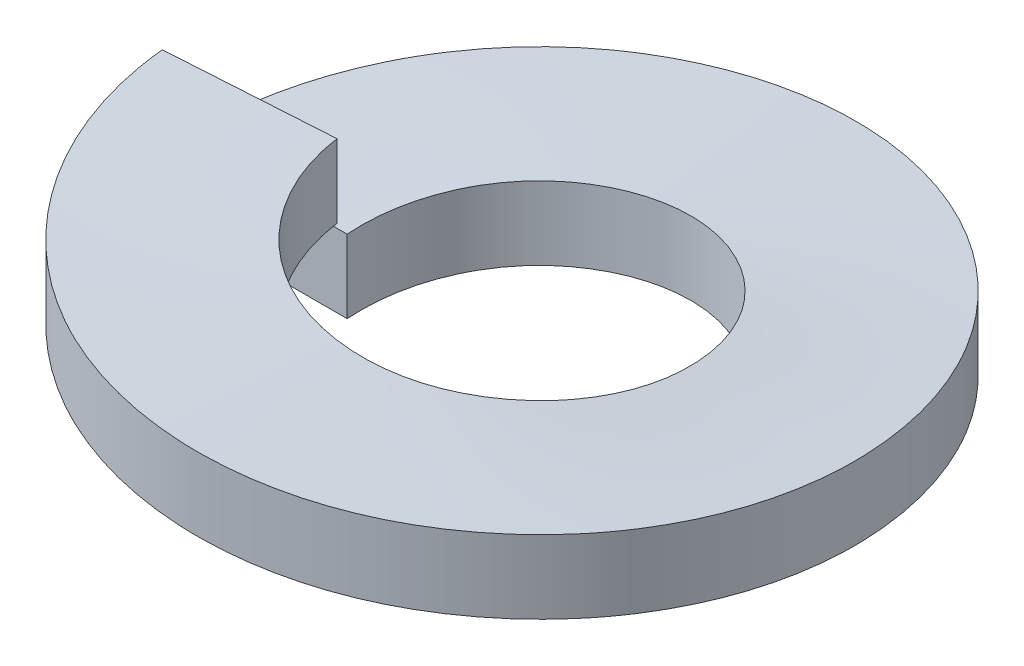
ISO-10303-21;
HEADER;
FILE_DESCRIPTION(('STEP AP214'),'2;1');
FILE_NAME('part.step','',(''),(''),'','','');
FILE_SCHEMA(('AUTOMOTIVE_DESIGN { 1 0 10303 214 1 1 1 1 }'));
ENDSEC;
DATA;
#1=APPLICATION_CONTEXT('core data for automotive mechanical design processes');
#2=APPLICATION_PROTOCOL_DEFINITION('international standard','automotive_design',2000,#1);
#3=PRODUCT_CONTEXT('',#1,'mechanical');
#4=PRODUCT('Part','Part','',(#3));
#5=PRODUCT_RELATED_PRODUCT_CATEGORY('part','',(#4));
#6=PRODUCT_DEFINITION_FORMATION('','',#4);
#7=PRODUCT_DEFINITION_CONTEXT('part definition',#1,'design');
#8=PRODUCT_DEFINITION('design','',#6,#7);
#9=PRODUCT_DEFINITION_SHAPE('','',#8);
#10=(LENGTH_UNIT() NAMED_UNIT(*) SI_UNIT(.MILLI.,.METRE.));
#11=(NAMED_UNIT(*) PLANE_ANGLE_UNIT() SI_UNIT($,.RADIAN.));
#12=(NAMED_UNIT(*) SI_UNIT($,.STERADIAN.) SOLID_ANGLE_UNIT());
#13=UNCERTAINTY_MEASURE_WITH_UNIT(LENGTH_MEASURE(1.E-05),#10,'distance_accuracy_value','');
#14=(GEOMETRIC_REPRESENTATION_CONTEXT(3) GLOBAL_UNCERTAINTY_ASSIGNED_CONTEXT((#13)) GLOBAL_UNIT_ASSIGNED_CONTEXT((#10,
#11,#12)) REPRESENTATION_CONTEXT('',''));
#15=CARTESIAN_POINT('',(0.,0.,0.));
#16=DIRECTION('',(0.,0.,1.));
#17=DIRECTION('',(1.,0.,0.));
#18=AXIS2_PLACEMENT_3D('',#15,#16,#17);
#19=CARTESIAN_POINT('',(-2.286,0.,0.));
#20=DIRECTION('',(0.,0.,1.));
#21=DIRECTION('',(1.,0.,0.));
#22=AXIS2_PLACEMENT_3D('',#19,#20,#21);
#23=PLANE('',#22);
#24=DIRECTION('',(0.,-1.,0.));
#25=VECTOR('',#24,1.);
#26=CARTESIAN_POINT('',(-2.286,0.508,0.));
#27=LINE('',#26,#25);
#28=CARTESIAN_POINT('',(-2.286,0.508,0.));
#29=VERTEX_POINT('',#28);
#30=CARTESIAN_POINT('',(-2.286,0.,0.));
#31=VERTEX_POINT('',#30);
#32=EDGE_CURVE('E84',#29,#31,#27,.T.);
#33=ORIENTED_EDGE('',*,*,#32,.T.);
#34=DIRECTION('',(1.,0.,0.));
#35=VECTOR('',#34,1.);
#36=CARTESIAN_POINT('',(-2.286,0.,0.));
#37=LINE('',#36,#35);
#38=CARTESIAN_POINT('',(-1.143,0.,0.));
#39=VERTEX_POINT('',#38);
#40=EDGE_CURVE('E77',#31,#39,#37,.T.);
#41=ORIENTED_EDGE('',*,*,#40,.T.);
#42=DIRECTION('',(0.,1.,0.));
#43=VECTOR('',#42,1.);
#44=CARTESIAN_POINT('',(-1.143,0.508000000000001,0.));
#45=LINE('',#44,#43);
#46=CARTESIAN_POINT('',(-1.143,0.508000000000001,0.));
#47=VERTEX_POINT('',#46);
#48=EDGE_CURVE('E72',#39,#47,#45,.T.);
#49=ORIENTED_EDGE('',*,*,#48,.T.);
#50=DIRECTION('',(-1.,0.,0.));
#51=VECTOR('',#50,1.);
#52=CARTESIAN_POINT('',(-2.286,0.508,0.));
#53=LINE('',#52,#51);
#54=EDGE_CURVE('E67',#47,#29,#53,.T.);
#55=ORIENTED_EDGE('',*,*,#54,.T.);
#56=EDGE_LOOP('',(#33,#41,#49,#55));
#57=FACE_BOUND('',#56,.T.);
#58=ADVANCED_FACE('F32',(#57),#23,.T.);
#59=CARTESIAN_POINT('',(-2.28148910118703,0.6096,0.14353912764398));
#60=DIRECTION('',(0.0627905195293,0.,0.998026728428272));
#61=DIRECTION('',(0.998026728428272,0.,-0.0627905195293));
#62=AXIS2_PLACEMENT_3D('',#59,#60,#61);
#63=PLANE('',#62);
#64=DIRECTION('',(0.,-1.,0.));
#65=VECTOR('',#64,1.);
#66=CARTESIAN_POINT('',(-2.28148910118703,1.1176,0.14353912764398));
#67=LINE('',#66,#65);
#68=CARTESIAN_POINT('',(-2.28148910118703,1.1176,0.143539127643978));
#69=VERTEX_POINT('',#68);
#70=CARTESIAN_POINT('',(-2.28148910118703,0.6096,0.143539127643979));
#71=VERTEX_POINT('',#70);
#72=EDGE_CURVE('E92',#69,#71,#67,.T.);
#73=ORIENTED_EDGE('',*,*,#72,.F.);
#74=DIRECTION('',(-0.998026728428272,0.,0.0627905195293));
#75=VECTOR('',#74,1.);
#76=CARTESIAN_POINT('',(-2.28148910118703,1.1176,0.14353912764398));
#77=LINE('',#76,#75);
#78=CARTESIAN_POINT('',(-1.14074455059351,1.1176,0.0717695638219887));
#79=VERTEX_POINT('',#78);
#80=EDGE_CURVE('E11',#79,#69,#77,.T.);
#81=ORIENTED_EDGE('',*,*,#80,.F.);
#82=DIRECTION('',(0.,1.,0.));
#83=VECTOR('',#82,1.);
#84=CARTESIAN_POINT('',(-1.14074455059351,1.1176,0.0717695638219897));
#85=LINE('',#84,#83);
#86=CARTESIAN_POINT('',(-1.14074455059352,0.6096,0.0717695638219895));
#87=VERTEX_POINT('',#86);
#88=EDGE_CURVE('E46',#87,#79,#85,.T.);
#89=ORIENTED_EDGE('',*,*,#88,.F.);
#90=DIRECTION('',(0.998026728428272,0.,-0.0627905195293));
#91=VECTOR('',#90,1.);
#92=CARTESIAN_POINT('',(-2.28148910118703,0.6096,0.14353912764398));
#93=LINE('',#92,#91);
#94=EDGE_CURVE('E55',#71,#87,#93,.T.);
#95=ORIENTED_EDGE('',*,*,#94,.F.);
#96=EDGE_LOOP('',(#73,#81,#89,#95));
#97=FACE_BOUND('',#96,.T.);
#98=ADVANCED_FACE('F138',(#97),#63,.F.);
#99=CARTESIAN_POINT('',(0.,0.,0.));
#100=DIRECTION('',(0.,1.,0.));
#101=DIRECTION('',(0.,0.,1.));
#102=AXIS2_PLACEMENT_3D('',#99,#100,#101);
#103=CYLINDRICAL_SURFACE('',#102,2.286);
#104=CARTESIAN_POINT('',(-2.286,0.,0.));
#105=CARTESIAN_POINT('',(-2.286,0.0508,-1.30391137923316));
#106=CARTESIAN_POINT('',(-1.16366867640534,0.1016,-1.96765627373102));
#107=CARTESIAN_POINT('',(-0.0413373528106882,0.1524,-2.63140116822888));
#108=CARTESIAN_POINT('',(1.10128889899653,0.2032,-2.00323707058027));
#109=CARTESIAN_POINT('',(2.24391515080375,0.254,-1.37507297293165));
#110=CARTESIAN_POINT('',(2.28487199699606,0.3048,-0.0718049952525849));
#111=CARTESIAN_POINT('',(2.32582884318838,0.3556,1.23146298242648));
#112=CARTESIAN_POINT('',(1.22490005332197,0.4064,1.93013363769762));
#113=CARTESIAN_POINT('',(0.12397126345556,0.4572,2.62880429296875));
#114=CARTESIAN_POINT('',(-1.03782228240463,0.508,2.0368409142946));
#115=CARTESIAN_POINT('',(-2.19961582826482,0.5588,1.44487753562044));
#116=CARTESIAN_POINT('',(-2.28148910118703,0.6096,0.143539127643978));
#117=(BOUNDED_CURVE() B_SPLINE_CURVE(2,(#104,#105,#106,#107,#108,#109,#110,#111,#112,#113,#114,
#115,#116),.UNSPECIFIED.,.F.,.F.) B_SPLINE_CURVE_WITH_KNOTS((3,2,2,2,2,2,3),(0.,
0.166666666666667,0.333333333333333,0.5,0.666666666666667,0.833333333333333,1.),
.UNSPECIFIED.) CURVE() GEOMETRIC_REPRESENTATION_ITEM() RATIONAL_B_SPLINE_CURVE((1.,
0.868631514438191,1.,0.868631514438191,1.,0.868631514438191,1.,0.868631514438191,1.,
0.868631514438191,1.,0.868631514438191,1.)) REPRESENTATION_ITEM(''));
#118=EDGE_CURVE('E87',#31,#71,#117,.T.);
#119=ORIENTED_EDGE('',*,*,#118,.F.);
#120=ORIENTED_EDGE('',*,*,#32,.F.);
#121=CARTESIAN_POINT('',(-2.286,0.508,0.));
#122=CARTESIAN_POINT('',(-2.286,0.5588,-1.30391137923316));
#123=CARTESIAN_POINT('',(-1.16366867640534,0.6096,-1.96765627373102));
#124=CARTESIAN_POINT('',(-0.0413373528106876,0.6604,-2.63140116822888));
#125=CARTESIAN_POINT('',(1.10128889899653,0.7112,-2.00323707058027));
#126=CARTESIAN_POINT('',(2.24391515080375,0.762,-1.37507297293165));
#127=CARTESIAN_POINT('',(2.28487199699606,0.8128,-0.0718049952525839));
#128=CARTESIAN_POINT('',(2.32582884318838,0.8636,1.23146298242648));
#129=CARTESIAN_POINT('',(1.22490005332197,0.9144,1.93013363769762));
#130=CARTESIAN_POINT('',(0.123971263455557,0.9652,2.62880429296875));
#131=CARTESIAN_POINT('',(-1.03782228240463,1.016,2.0368409142946));
#132=CARTESIAN_POINT('',(-2.19961582826482,1.0668,1.44487753562044));
#133=CARTESIAN_POINT('',(-2.28148910118703,1.1176,0.143539127643976));
#134=(BOUNDED_CURVE() B_SPLINE_CURVE(2,(#121,#122,#123,#124,#125,#126,#127,#128,#129,#130,#131,
#132,#133),.UNSPECIFIED.,.F.,.F.) B_SPLINE_CURVE_WITH_KNOTS((3,2,2,2,2,2,3),(0.,
0.166666666666667,0.333333333333333,0.5,0.666666666666667,0.833333333333333,1.),
.UNSPECIFIED.) CURVE() GEOMETRIC_REPRESENTATION_ITEM() RATIONAL_B_SPLINE_CURVE((1.,
0.868631514438191,1.,0.868631514438191,1.,0.868631514438191,1.,0.868631514438191,1.,
0.868631514438191,1.,0.868631514438191,1.)) REPRESENTATION_ITEM(''));
#135=EDGE_CURVE('E86',#29,#69,#134,.T.);
#136=ORIENTED_EDGE('',*,*,#135,.T.);
#137=ORIENTED_EDGE('',*,*,#72,.T.);
#138=EDGE_LOOP('',(#119,#120,#136,#137));
#139=FACE_BOUND('',#138,.T.);
#140=ADVANCED_FACE('F85',(#139),#103,.T.);
#141=CARTESIAN_POINT('',(-2.286,0.,0.));
#142=CARTESIAN_POINT('',(-2.286,0.0508,-1.30391137923316));
#143=CARTESIAN_POINT('',(-1.16366867640534,0.1016,-1.96765627373102));
#144=CARTESIAN_POINT('',(-0.0413373528106882,0.1524,-2.63140116822888));
#145=CARTESIAN_POINT('',(1.10128889899653,0.2032,-2.00323707058027));
#146=CARTESIAN_POINT('',(2.24391515080375,0.254,-1.37507297293165));
#147=CARTESIAN_POINT('',(2.28487199699606,0.3048,-0.0718049952525849));
#148=CARTESIAN_POINT('',(2.32582884318838,0.3556,1.23146298242648));
#149=CARTESIAN_POINT('',(1.22490005332197,0.4064,1.93013363769762));
#150=CARTESIAN_POINT('',(0.12397126345556,0.4572,2.62880429296875));
#151=CARTESIAN_POINT('',(-1.03782228240463,0.508,2.0368409142946));
#152=CARTESIAN_POINT('',(-2.19961582826482,0.5588,1.44487753562044));
#153=CARTESIAN_POINT('',(-2.28148910118703,0.6096,0.143539127643978));
#154=CARTESIAN_POINT('',(-1.143,0.,0.));
#155=CARTESIAN_POINT('',(-1.143,0.0508,-0.651955689616579));
#156=CARTESIAN_POINT('',(-0.581834338202673,0.1016,-0.98382813686551));
#157=CARTESIAN_POINT('',(-0.0206686764053441,0.1524,-1.31570058411444));
#158=CARTESIAN_POINT('',(0.550644449498266,0.2032,-1.00161853529014));
#159=CARTESIAN_POINT('',(1.12195757540188,0.254,-0.687536486465828));
#160=CARTESIAN_POINT('',(1.14243599849803,0.3048,-0.0359024976262925));
#161=CARTESIAN_POINT('',(1.16291442159419,0.3556,0.615731491213243));
#162=CARTESIAN_POINT('',(0.612450026660985,0.4064,0.96506681884881));
#163=CARTESIAN_POINT('',(0.0619856317277798,0.4572,1.31440214648438));
#164=CARTESIAN_POINT('',(-0.518911141202314,0.508,1.0184204571473));
#165=CARTESIAN_POINT('',(-1.09980791413241,0.5588,0.722438767810222));
#166=CARTESIAN_POINT('',(-1.14074455059352,0.6096,0.071769563821989));
#167=(BOUNDED_SURFACE() B_SPLINE_SURFACE(1,2,((#141,#142,#143,#144,#145,#146,#147,#148,#149,
#150,#151,#152,#153),(#154,#155,#156,#157,#158,#159,#160,#161,#162,#163,#164,#165,#166)),
.UNSPECIFIED.,.F.,.F.,.F.) B_SPLINE_SURFACE_WITH_KNOTS((2,2),(3,2,2,2,2,2,3),(0.,1.),(0.,
0.166666666666667,0.333333333333333,0.5,0.666666666666667,0.833333333333333,1.),
.UNSPECIFIED.) GEOMETRIC_REPRESENTATION_ITEM() RATIONAL_B_SPLINE_SURFACE(((1.,0.868631514438191,
1.,0.868631514438191,1.,0.868631514438191,1.,0.868631514438191,1.,0.868631514438191,1.,
0.868631514438191,1.),(1.,0.868631514438191,1.,0.868631514438191,1.,0.868631514438191,1.,
0.868631514438191,1.,0.868631514438191,1.,0.868631514438191,1.))) REPRESENTATION_ITEM('') SURFACE());
#168=CARTESIAN_POINT('',(-1.143,0.,0.));
#169=CARTESIAN_POINT('',(-1.143,0.0508,-0.651955689616579));
#170=CARTESIAN_POINT('',(-0.581834338202673,0.1016,-0.98382813686551));
#171=CARTESIAN_POINT('',(-0.0206686764053441,0.1524,-1.31570058411444));
#172=CARTESIAN_POINT('',(0.550644449498266,0.2032,-1.00161853529014));
#173=CARTESIAN_POINT('',(1.12195757540188,0.254,-0.687536486465828));
#174=CARTESIAN_POINT('',(1.14243599849803,0.3048,-0.0359024976262925));
#175=CARTESIAN_POINT('',(1.16291442159419,0.3556,0.615731491213243));
#176=CARTESIAN_POINT('',(0.612450026660985,0.4064,0.96506681884881));
#177=CARTESIAN_POINT('',(0.0619856317277798,0.4572,1.31440214648438));
#178=CARTESIAN_POINT('',(-0.518911141202314,0.508,1.0184204571473));
#179=CARTESIAN_POINT('',(-1.09980791413241,0.5588,0.722438767810222));
#180=CARTESIAN_POINT('',(-1.14074455059352,0.6096,0.071769563821989));
#181=(BOUNDED_CURVE() B_SPLINE_CURVE(2,(#168,#169,#170,#171,#172,#173,#174,#175,#176,#177,#178,
#179,#180),.UNSPECIFIED.,.F.,.F.) B_SPLINE_CURVE_WITH_KNOTS((3,2,2,2,2,2,3),(0.,
0.166666666666667,0.333333333333333,0.5,0.666666666666667,0.833333333333333,1.),
.UNSPECIFIED.) CURVE() GEOMETRIC_REPRESENTATION_ITEM() RATIONAL_B_SPLINE_CURVE((1.,
0.868631514438191,1.,0.868631514438191,1.,0.868631514438191,1.,0.868631514438191,1.,
0.868631514438191,1.,0.868631514438191,1.)) REPRESENTATION_ITEM(''));
#182=EDGE_CURVE('E107',#39,#87,#181,.T.);
#183=ORIENTED_EDGE('',*,*,#182,.F.);
#184=ORIENTED_EDGE('',*,*,#40,.F.);
#185=ORIENTED_EDGE('',*,*,#118,.T.);
#186=ORIENTED_EDGE('',*,*,#94,.T.);
#187=EDGE_LOOP('',(#183,#184,#185,#186));
#188=FACE_BOUND('',#187,.T.);
#189=ADVANCED_FACE('F125',(#188),#167,.F.);
#190=CARTESIAN_POINT('',(0.,0.,0.));
#191=DIRECTION('',(0.,1.,0.));
#192=DIRECTION('',(0.,0.,1.));
#193=AXIS2_PLACEMENT_3D('',#190,#191,#192);
#194=CYLINDRICAL_SURFACE('',#193,1.143);
#195=CARTESIAN_POINT('',(-1.143,0.508000000000001,0.));
#196=CARTESIAN_POINT('',(-1.143,0.558800000000001,-0.651955689616577));
#197=CARTESIAN_POINT('',(-0.581834338202671,0.609600000000001,-0.983828136865507));
#198=CARTESIAN_POINT('',(-0.0206686764053438,0.660400000000001,-1.31570058411444));
#199=CARTESIAN_POINT('',(0.550644449498265,0.711200000000001,-1.00161853529013));
#200=CARTESIAN_POINT('',(1.12195757540187,0.762000000000001,-0.687536486465825));
#201=CARTESIAN_POINT('',(1.14243599849803,0.812800000000001,-0.0359024976262919));
#202=CARTESIAN_POINT('',(1.16291442159419,0.863600000000001,0.615731491213241));
#203=CARTESIAN_POINT('',(0.612450026660982,0.914400000000001,0.965066818848808));
#204=CARTESIAN_POINT('',(0.0619856317277785,0.965200000000001,1.31440214648437));
#205=CARTESIAN_POINT('',(-0.518911141202315,1.016,1.0184204571473));
#206=CARTESIAN_POINT('',(-1.09980791413241,1.0668,0.722438767810218));
#207=CARTESIAN_POINT('',(-1.14074455059351,1.1176,0.0717695638219877));
#208=(BOUNDED_CURVE() B_SPLINE_CURVE(2,(#195,#196,#197,#198,#199,#200,#201,#202,#203,#204,#205,
#206,#207),.UNSPECIFIED.,.F.,.F.) B_SPLINE_CURVE_WITH_KNOTS((3,2,2,2,2,2,3),(0.,
0.166666666666667,0.333333333333333,0.5,0.666666666666667,0.833333333333333,1.),
.UNSPECIFIED.) CURVE() GEOMETRIC_REPRESENTATION_ITEM() RATIONAL_B_SPLINE_CURVE((1.,
0.868631514438191,1.,0.868631514438191,1.,0.868631514438191,1.,0.868631514438191,1.,
0.868631514438191,1.,0.868631514438191,1.)) REPRESENTATION_ITEM(''));
#209=EDGE_CURVE('E39',#47,#79,#208,.T.);
#210=ORIENTED_EDGE('',*,*,#209,.F.);
#211=ORIENTED_EDGE('',*,*,#48,.F.);
#212=ORIENTED_EDGE('',*,*,#182,.T.);
#213=ORIENTED_EDGE('',*,*,#88,.T.);
#214=EDGE_LOOP('',(#210,#211,#212,#213));
#215=FACE_BOUND('',#214,.T.);
#216=ADVANCED_FACE('F123',(#215),#194,.F.);
#217=CARTESIAN_POINT('',(-1.143,0.508000000000001,0.));
#218=CARTESIAN_POINT('',(-1.143,0.558800000000001,-0.651955689616577));
#219=CARTESIAN_POINT('',(-0.581834338202671,0.609600000000001,-0.983828136865508));
#220=CARTESIAN_POINT('',(-0.0206686764053438,0.660400000000001,-1.31570058411444));
#221=CARTESIAN_POINT('',(0.550644449498265,0.711200000000001,-1.00161853529013));
#222=CARTESIAN_POINT('',(1.12195757540187,0.762000000000001,-0.687536486465825));
#223=CARTESIAN_POINT('',(1.14243599849803,0.812800000000001,-0.0359024976262919));
#224=CARTESIAN_POINT('',(1.16291442159419,0.863600000000001,0.615731491213241));
#225=CARTESIAN_POINT('',(0.612450026660982,0.914400000000001,0.965066818848808));
#226=CARTESIAN_POINT('',(0.0619856317277785,0.965200000000001,1.31440214648437));
#227=CARTESIAN_POINT('',(-0.518911141202315,1.016,1.0184204571473));
#228=CARTESIAN_POINT('',(-1.09980791413241,1.0668,0.722438767810219));
#229=CARTESIAN_POINT('',(-1.14074455059351,1.1176,0.0717695638219877));
#230=CARTESIAN_POINT('',(-2.286,0.508,0.));
#231=CARTESIAN_POINT('',(-2.286,0.5588,-1.30391137923316));
#232=CARTESIAN_POINT('',(-1.16366867640534,0.6096,-1.96765627373102));
#233=CARTESIAN_POINT('',(-0.0413373528106876,0.6604,-2.63140116822888));
#234=CARTESIAN_POINT('',(1.10128889899653,0.7112,-2.00323707058027));
#235=CARTESIAN_POINT('',(2.24391515080375,0.762,-1.37507297293165));
#236=CARTESIAN_POINT('',(2.28487199699606,0.8128,-0.0718049952525839));
#237=CARTESIAN_POINT('',(2.32582884318838,0.8636,1.23146298242648));
#238=CARTESIAN_POINT('',(1.22490005332197,0.9144,1.93013363769762));
#239=CARTESIAN_POINT('',(0.123971263455557,0.9652,2.62880429296875));
#240=CARTESIAN_POINT('',(-1.03782228240463,1.016,2.0368409142946));
#241=CARTESIAN_POINT('',(-2.19961582826482,1.0668,1.44487753562044));
#242=CARTESIAN_POINT('',(-2.28148910118703,1.1176,0.143539127643976));
#243=(BOUNDED_SURFACE() B_SPLINE_SURFACE(1,2,((#217,#218,#219,#220,#221,#222,#223,#224,#225,
#226,#227,#228,#229),(#230,#231,#232,#233,#234,#235,#236,#237,#238,#239,#240,#241,#242)),
.UNSPECIFIED.,.F.,.F.,.F.) B_SPLINE_SURFACE_WITH_KNOTS((2,2),(3,2,2,2,2,2,3),(0.,1.),(0.,
0.166666666666667,0.333333333333333,0.5,0.666666666666667,0.833333333333333,1.),
.UNSPECIFIED.) GEOMETRIC_REPRESENTATION_ITEM() RATIONAL_B_SPLINE_SURFACE(((1.,0.868631514438191,
1.,0.868631514438191,1.,0.868631514438191,1.,0.868631514438191,1.,0.868631514438191,1.,
0.868631514438191,1.),(1.,0.868631514438191,1.,0.868631514438191,1.,0.868631514438191,1.,
0.868631514438191,1.,0.868631514438191,1.,0.868631514438191,1.))) REPRESENTATION_ITEM('') SURFACE());
#244=ORIENTED_EDGE('',*,*,#80,.T.);
#245=ORIENTED_EDGE('',*,*,#135,.F.);
#246=ORIENTED_EDGE('',*,*,#54,.F.);
#247=ORIENTED_EDGE('',*,*,#209,.T.);
#248=EDGE_LOOP('',(#244,#245,#246,#247));
#249=FACE_BOUND('',#248,.T.);
#250=ADVANCED_FACE('F90',(#249),#243,.F.);
#251=CLOSED_SHELL('',(#58,#98,#140,#189,#216,#250));
#252=MANIFOLD_SOLID_BREP('B2',#251);
#253=ADVANCED_BREP_SHAPE_REPRESENTATION('',(#18,#252),#14);
#254=SHAPE_DEFINITION_REPRESENTATION(#9,#253);
ENDSEC;
END-ISO-10303-21;
